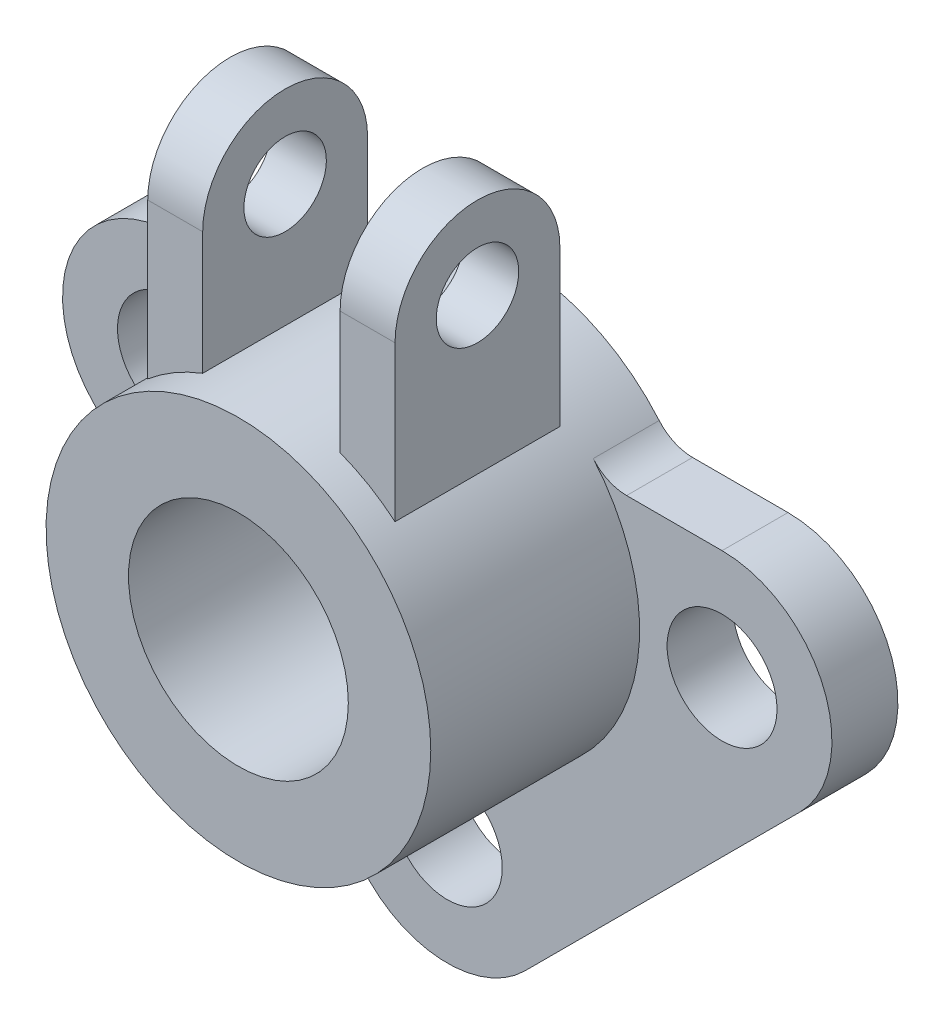
ISO-10303-21;
HEADER;
FILE_DESCRIPTION(('STEP AP214'),'2;1');
FILE_NAME('part.step','',(''),(''),'','','');
FILE_SCHEMA(('AUTOMOTIVE_DESIGN { 1 0 10303 214 1 1 1 1 }'));
ENDSEC;
DATA;
#1=APPLICATION_CONTEXT('core data for automotive mechanical design processes');
#2=APPLICATION_PROTOCOL_DEFINITION('international standard','automotive_design',2000,#1);
#3=PRODUCT_CONTEXT('',#1,'mechanical');
#4=PRODUCT('Part','Part','',(#3));
#5=PRODUCT_RELATED_PRODUCT_CATEGORY('part','',(#4));
#6=PRODUCT_DEFINITION_FORMATION('','',#4);
#7=PRODUCT_DEFINITION_CONTEXT('part definition',#1,'design');
#8=PRODUCT_DEFINITION('design','',#6,#7);
#9=PRODUCT_DEFINITION_SHAPE('','',#8);
#10=(LENGTH_UNIT() NAMED_UNIT(*) SI_UNIT(.MILLI.,.METRE.));
#11=(NAMED_UNIT(*) PLANE_ANGLE_UNIT() SI_UNIT($,.RADIAN.));
#12=(NAMED_UNIT(*) SI_UNIT($,.STERADIAN.) SOLID_ANGLE_UNIT());
#13=UNCERTAINTY_MEASURE_WITH_UNIT(LENGTH_MEASURE(1.E-05),#10,'distance_accuracy_value','');
#14=(GEOMETRIC_REPRESENTATION_CONTEXT(3) GLOBAL_UNCERTAINTY_ASSIGNED_CONTEXT((#13)) GLOBAL_UNIT_ASSIGNED_CONTEXT((#10,
#11,#12)) REPRESENTATION_CONTEXT('',''));
#15=CARTESIAN_POINT('',(0.,0.,0.));
#16=DIRECTION('',(0.,0.,1.));
#17=DIRECTION('',(1.,0.,0.));
#18=AXIS2_PLACEMENT_3D('',#15,#16,#17);
#19=CARTESIAN_POINT('',(225.,700.,140.));
#20=DIRECTION('',(1.,0.,0.));
#21=DIRECTION('',(0.,1.,0.));
#22=AXIS2_PLACEMENT_3D('',#19,#20,#21);
#23=PLANE('',#22);
#24=CARTESIAN_POINT('',(225.,550.,290.));
#25=DIRECTION('',(1.,0.,0.));
#26=DIRECTION('',(0.,1.,0.));
#27=AXIS2_PLACEMENT_3D('',#24,#25,#26);
#28=CIRCLE('',#27,75.);
#29=CARTESIAN_POINT('',(225.,625.,290.));
#30=VERTEX_POINT('',#29);
#31=EDGE_CURVE('E594',#30,#30,#28,.T.);
#32=ORIENTED_EDGE('',*,*,#31,.F.);
#33=EDGE_LOOP('',(#32));
#34=FACE_BOUND('',#33,.T.);
#35=DIRECTION('',(0.,1.,0.));
#36=VECTOR('',#35,1.);
#37=CARTESIAN_POINT('',(225.,700.,140.));
#38=LINE('',#37,#36);
#39=CARTESIAN_POINT('',(225.,268.09513236909,140.));
#40=VERTEX_POINT('',#39);
#41=CARTESIAN_POINT('',(225.,550.,140.));
#42=VERTEX_POINT('',#41);
#43=EDGE_CURVE('E225',#40,#42,#38,.T.);
#44=ORIENTED_EDGE('',*,*,#43,.T.);
#45=CARTESIAN_POINT('',(225.,550.,290.));
#46=DIRECTION('',(1.,0.,0.));
#47=DIRECTION('',(0.,1.,0.));
#48=AXIS2_PLACEMENT_3D('',#45,#46,#47);
#49=CIRCLE('',#48,150.);
#50=CARTESIAN_POINT('',(225.,550.,440.));
#51=VERTEX_POINT('',#50);
#52=EDGE_CURVE('E208',#42,#51,#49,.T.);
#53=ORIENTED_EDGE('',*,*,#52,.T.);
#54=DIRECTION('',(0.,1.,0.));
#55=VECTOR('',#54,1.);
#56=CARTESIAN_POINT('',(225.,700.,440.));
#57=LINE('',#56,#55);
#58=CARTESIAN_POINT('',(225.,268.09513236909,440.));
#59=VERTEX_POINT('',#58);
#60=EDGE_CURVE('E251',#59,#51,#57,.T.);
#61=ORIENTED_EDGE('',*,*,#60,.F.);
#62=DIRECTION('',(0.,0.,1.));
#63=VECTOR('',#62,1.);
#64=CARTESIAN_POINT('',(225.,268.09513236909,140.));
#65=LINE('',#64,#63);
#66=EDGE_CURVE('E233',#40,#59,#65,.T.);
#67=ORIENTED_EDGE('',*,*,#66,.F.);
#68=EDGE_LOOP('',(#44,#53,#61,#67));
#69=FACE_BOUND('',#68,.T.);
#70=ADVANCED_FACE('F83',(#34,#69),#23,.T.);
#71=CARTESIAN_POINT('',(125.,700.,140.));
#72=DIRECTION('',(-1.,0.,0.));
#73=DIRECTION('',(0.,-1.,0.));
#74=AXIS2_PLACEMENT_3D('',#71,#72,#73);
#75=PLANE('',#74);
#76=CARTESIAN_POINT('',(125.,550.,290.));
#77=DIRECTION('',(-1.,0.,0.));
#78=DIRECTION('',(0.,-1.,0.));
#79=AXIS2_PLACEMENT_3D('',#76,#77,#78);
#80=CIRCLE('',#79,75.);
#81=CARTESIAN_POINT('',(125.,475.,290.));
#82=VERTEX_POINT('',#81);
#83=EDGE_CURVE('E503',#82,#82,#80,.T.);
#84=ORIENTED_EDGE('',*,*,#83,.F.);
#85=EDGE_LOOP('',(#84));
#86=FACE_BOUND('',#85,.T.);
#87=CARTESIAN_POINT('',(125.,550.,290.));
#88=DIRECTION('',(-1.,0.,0.));
#89=DIRECTION('',(0.,-1.,0.));
#90=AXIS2_PLACEMENT_3D('',#87,#88,#89);
#91=CIRCLE('',#90,150.);
#92=CARTESIAN_POINT('',(125.,550.,440.));
#93=VERTEX_POINT('',#92);
#94=CARTESIAN_POINT('',(125.,550.,140.));
#95=VERTEX_POINT('',#94);
#96=EDGE_CURVE('E100',#93,#95,#91,.T.);
#97=ORIENTED_EDGE('',*,*,#96,.T.);
#98=DIRECTION('',(0.,-1.,0.));
#99=VECTOR('',#98,1.);
#100=CARTESIAN_POINT('',(125.,700.,140.));
#101=LINE('',#100,#99);
#102=CARTESIAN_POINT('',(125.,326.91742076555,140.));
#103=VERTEX_POINT('',#102);
#104=EDGE_CURVE('E227',#95,#103,#101,.T.);
#105=ORIENTED_EDGE('',*,*,#104,.T.);
#106=DIRECTION('',(0.,0.,1.));
#107=VECTOR('',#106,1.);
#108=CARTESIAN_POINT('',(125.,326.91742076555,140.));
#109=LINE('',#108,#107);
#110=CARTESIAN_POINT('',(125.,326.91742076555,440.));
#111=VERTEX_POINT('',#110);
#112=EDGE_CURVE('E250',#103,#111,#109,.T.);
#113=ORIENTED_EDGE('',*,*,#112,.T.);
#114=DIRECTION('',(0.,-1.,0.));
#115=VECTOR('',#114,1.);
#116=CARTESIAN_POINT('',(125.,700.,440.));
#117=LINE('',#116,#115);
#118=EDGE_CURVE('E242',#93,#111,#117,.T.);
#119=ORIENTED_EDGE('',*,*,#118,.F.);
#120=EDGE_LOOP('',(#97,#105,#113,#119));
#121=FACE_BOUND('',#120,.T.);
#122=ADVANCED_FACE('F458',(#86,#121),#75,.T.);
#123=CARTESIAN_POINT('',(-225.,700.,140.));
#124=DIRECTION('',(-1.,0.,0.));
#125=DIRECTION('',(0.,-1.,0.));
#126=AXIS2_PLACEMENT_3D('',#123,#124,#125);
#127=PLANE('',#126);
#128=CARTESIAN_POINT('',(-225.,550.,290.));
#129=DIRECTION('',(-1.,0.,0.));
#130=DIRECTION('',(0.,-1.,0.));
#131=AXIS2_PLACEMENT_3D('',#128,#129,#130);
#132=CIRCLE('',#131,75.);
#133=CARTESIAN_POINT('',(-225.,475.,290.));
#134=VERTEX_POINT('',#133);
#135=EDGE_CURVE('E230',#134,#134,#132,.F.);
#136=ORIENTED_EDGE('',*,*,#135,.T.);
#137=EDGE_LOOP('',(#136));
#138=FACE_BOUND('',#137,.T.);
#139=CARTESIAN_POINT('',(-225.,550.,290.));
#140=DIRECTION('',(-1.,0.,0.));
#141=DIRECTION('',(0.,-1.,0.));
#142=AXIS2_PLACEMENT_3D('',#139,#140,#141);
#143=CIRCLE('',#142,150.);
#144=CARTESIAN_POINT('',(-225.,550.,140.));
#145=VERTEX_POINT('',#144);
#146=CARTESIAN_POINT('',(-225.,550.,440.));
#147=VERTEX_POINT('',#146);
#148=EDGE_CURVE('E108',#145,#147,#143,.F.);
#149=ORIENTED_EDGE('',*,*,#148,.F.);
#150=DIRECTION('',(0.,-1.,0.));
#151=VECTOR('',#150,1.);
#152=CARTESIAN_POINT('',(-225.,700.,140.));
#153=LINE('',#152,#151);
#154=CARTESIAN_POINT('',(-225.,268.09513236909,140.));
#155=VERTEX_POINT('',#154);
#156=EDGE_CURVE('E479',#145,#155,#153,.T.);
#157=ORIENTED_EDGE('',*,*,#156,.T.);
#158=DIRECTION('',(0.,0.,1.));
#159=VECTOR('',#158,1.);
#160=CARTESIAN_POINT('',(-225.,268.09513236909,140.));
#161=LINE('',#160,#159);
#162=CARTESIAN_POINT('',(-225.,268.09513236909,440.));
#163=VERTEX_POINT('',#162);
#164=EDGE_CURVE('E254',#155,#163,#161,.T.);
#165=ORIENTED_EDGE('',*,*,#164,.T.);
#166=DIRECTION('',(0.,-1.,0.));
#167=VECTOR('',#166,1.);
#168=CARTESIAN_POINT('',(-225.,700.,440.));
#169=LINE('',#168,#167);
#170=EDGE_CURVE('E475',#147,#163,#169,.T.);
#171=ORIENTED_EDGE('',*,*,#170,.F.);
#172=EDGE_LOOP('',(#149,#157,#165,#171));
#173=FACE_BOUND('',#172,.T.);
#174=ADVANCED_FACE('F500',(#138,#173),#127,.T.);
#175=CARTESIAN_POINT('',(-125.,700.,140.));
#176=DIRECTION('',(1.,0.,0.));
#177=DIRECTION('',(0.,1.,0.));
#178=AXIS2_PLACEMENT_3D('',#175,#176,#177);
#179=PLANE('',#178);
#180=CARTESIAN_POINT('',(-125.,550.,290.));
#181=DIRECTION('',(1.,0.,0.));
#182=DIRECTION('',(0.,1.,0.));
#183=AXIS2_PLACEMENT_3D('',#180,#181,#182);
#184=CIRCLE('',#183,75.);
#185=CARTESIAN_POINT('',(-125.,625.,290.));
#186=VERTEX_POINT('',#185);
#187=EDGE_CURVE('E87',#186,#186,#184,.T.);
#188=ORIENTED_EDGE('',*,*,#187,.F.);
#189=EDGE_LOOP('',(#188));
#190=FACE_BOUND('',#189,.T.);
#191=DIRECTION('',(0.,1.,0.));
#192=VECTOR('',#191,1.);
#193=CARTESIAN_POINT('',(-125.,700.,140.));
#194=LINE('',#193,#192);
#195=CARTESIAN_POINT('',(-125.,326.91742076555,140.));
#196=VERTEX_POINT('',#195);
#197=CARTESIAN_POINT('',(-125.,550.,140.));
#198=VERTEX_POINT('',#197);
#199=EDGE_CURVE('E474',#196,#198,#194,.T.);
#200=ORIENTED_EDGE('',*,*,#199,.T.);
#201=CARTESIAN_POINT('',(-125.,550.,290.));
#202=DIRECTION('',(1.,0.,0.));
#203=DIRECTION('',(0.,1.,0.));
#204=AXIS2_PLACEMENT_3D('',#201,#202,#203);
#205=CIRCLE('',#204,150.);
#206=CARTESIAN_POINT('',(-125.,550.,440.));
#207=VERTEX_POINT('',#206);
#208=EDGE_CURVE('E218',#198,#207,#205,.T.);
#209=ORIENTED_EDGE('',*,*,#208,.T.);
#210=DIRECTION('',(0.,1.,0.));
#211=VECTOR('',#210,1.);
#212=CARTESIAN_POINT('',(-125.,700.,440.));
#213=LINE('',#212,#211);
#214=CARTESIAN_POINT('',(-125.,326.91742076555,440.));
#215=VERTEX_POINT('',#214);
#216=EDGE_CURVE('E465',#215,#207,#213,.T.);
#217=ORIENTED_EDGE('',*,*,#216,.F.);
#218=DIRECTION('',(0.,0.,1.));
#219=VECTOR('',#218,1.);
#220=CARTESIAN_POINT('',(-125.,326.91742076555,140.));
#221=LINE('',#220,#219);
#222=EDGE_CURVE('E245',#196,#215,#221,.T.);
#223=ORIENTED_EDGE('',*,*,#222,.F.);
#224=EDGE_LOOP('',(#200,#209,#217,#223));
#225=FACE_BOUND('',#224,.T.);
#226=ADVANCED_FACE('F498',(#190,#225),#179,.T.);
#227=CARTESIAN_POINT('',(0.,0.,140.));
#228=DIRECTION('',(0.,0.,-1.));
#229=DIRECTION('',(-1.,0.,0.));
#230=AXIS2_PLACEMENT_3D('',#227,#228,#229);
#231=PLANE('',#230);
#232=ORIENTED_EDGE('',*,*,#156,.F.);
#233=DIRECTION('',(1.,0.,0.));
#234=VECTOR('',#233,1.);
#235=CARTESIAN_POINT('',(-437.132034355965,550.,140.));
#236=LINE('',#235,#234);
#237=EDGE_CURVE('E229',#145,#198,#236,.T.);
#238=ORIENTED_EDGE('',*,*,#237,.T.);
#239=ORIENTED_EDGE('',*,*,#199,.F.);
#240=CARTESIAN_POINT('',(0.,0.,140.));
#241=DIRECTION('',(0.,0.,-1.));
#242=DIRECTION('',(-1.,0.,0.));
#243=AXIS2_PLACEMENT_3D('',#240,#241,#242);
#244=CIRCLE('',#243,350.);
#245=EDGE_CURVE('E471',#155,#196,#244,.T.);
#246=ORIENTED_EDGE('',*,*,#245,.F.);
#247=EDGE_LOOP('',(#232,#238,#239,#246));
#248=FACE_BOUND('',#247,.T.);
#249=ADVANCED_FACE('F509',(#248),#231,.T.);
#250=CARTESIAN_POINT('',(0.,0.,440.));
#251=DIRECTION('',(0.,0.,-1.));
#252=DIRECTION('',(-1.,0.,0.));
#253=AXIS2_PLACEMENT_3D('',#250,#251,#252);
#254=PLANE('',#253);
#255=DIRECTION('',(1.,0.,0.));
#256=VECTOR('',#255,1.);
#257=CARTESIAN_POINT('',(-437.132034355965,550.,440.));
#258=LINE('',#257,#256);
#259=EDGE_CURVE('E219',#147,#207,#258,.T.);
#260=ORIENTED_EDGE('',*,*,#259,.F.);
#261=ORIENTED_EDGE('',*,*,#170,.T.);
#262=CARTESIAN_POINT('',(0.,0.,440.));
#263=DIRECTION('',(0.,0.,-1.));
#264=DIRECTION('',(-1.,0.,0.));
#265=AXIS2_PLACEMENT_3D('',#262,#263,#264);
#266=CIRCLE('',#265,350.);
#267=EDGE_CURVE('E460',#163,#215,#266,.T.);
#268=ORIENTED_EDGE('',*,*,#267,.T.);
#269=ORIENTED_EDGE('',*,*,#216,.T.);
#270=EDGE_LOOP('',(#260,#261,#268,#269));
#271=FACE_BOUND('',#270,.T.);
#272=ADVANCED_FACE('F449',(#271),#254,.F.);
#273=CARTESIAN_POINT('',(0.,0.,500.));
#274=DIRECTION('',(0.,0.,-1.));
#275=DIRECTION('',(-1.,0.,0.));
#276=AXIS2_PLACEMENT_3D('',#273,#274,#275);
#277=CYLINDRICAL_SURFACE('',#276,350.);
#278=ORIENTED_EDGE('',*,*,#164,.F.);
#279=ORIENTED_EDGE('',*,*,#245,.T.);
#280=ORIENTED_EDGE('',*,*,#222,.T.);
#281=ORIENTED_EDGE('',*,*,#267,.F.);
#282=EDGE_LOOP('',(#278,#279,#280,#281));
#283=FACE_BOUND('',#282,.T.);
#284=CARTESIAN_POINT('',(0.,0.,0.));
#285=DIRECTION('',(0.,0.,1.));
#286=DIRECTION('',(1.,0.,0.));
#287=AXIS2_PLACEMENT_3D('',#284,#285,#286);
#288=CIRCLE('',#287,350.);
#289=CARTESIAN_POINT('',(265.628330475733,227.906976744186,0.));
#290=VERTEX_POINT('',#289);
#291=CARTESIAN_POINT('',(-265.628330475733,227.906976744186,0.));
#292=VERTEX_POINT('',#291);
#293=EDGE_CURVE('E371',#290,#292,#288,.T.);
#294=ORIENTED_EDGE('',*,*,#293,.T.);
#295=DIRECTION('',(0.,0.,-1.));
#296=VECTOR('',#295,1.);
#297=CARTESIAN_POINT('',(-265.628330475733,227.906976744186,500.));
#298=LINE('',#297,#296);
#299=CARTESIAN_POINT('',(-265.628330475733,227.906976744186,120.));
#300=VERTEX_POINT('',#299);
#301=EDGE_CURVE('E389',#292,#300,#298,.F.);
#302=ORIENTED_EDGE('',*,*,#301,.T.);
#303=CARTESIAN_POINT('',(0.,0.,120.));
#304=DIRECTION('',(0.,0.,1.));
#305=DIRECTION('',(1.,0.,0.));
#306=AXIS2_PLACEMENT_3D('',#303,#304,#305);
#307=CIRCLE('',#306,350.);
#308=CARTESIAN_POINT('',(265.628330475733,227.906976744186,120.));
#309=VERTEX_POINT('',#308);
#310=EDGE_CURVE('E267',#300,#309,#307,.T.);
#311=ORIENTED_EDGE('',*,*,#310,.T.);
#312=DIRECTION('',(0.,0.,-1.));
#313=VECTOR('',#312,1.);
#314=CARTESIAN_POINT('',(265.628330475733,227.906976744186,500.));
#315=LINE('',#314,#313);
#316=EDGE_CURVE('E385',#309,#290,#315,.T.);
#317=ORIENTED_EDGE('',*,*,#316,.T.);
#318=EDGE_LOOP('',(#294,#302,#311,#317));
#319=FACE_BOUND('',#318,.T.);
#320=CARTESIAN_POINT('',(0.,0.,500.));
#321=DIRECTION('',(0.,0.,1.));
#322=DIRECTION('',(1.,0.,0.));
#323=AXIS2_PLACEMENT_3D('',#320,#321,#322);
#324=CIRCLE('',#323,350.);
#325=CARTESIAN_POINT('',(350.,0.,500.));
#326=VERTEX_POINT('',#325);
#327=EDGE_CURVE('E370',#326,#326,#324,.T.);
#328=ORIENTED_EDGE('',*,*,#327,.F.);
#329=EDGE_LOOP('',(#328));
#330=FACE_BOUND('',#329,.T.);
#331=CARTESIAN_POINT('',(0.,0.,140.));
#332=DIRECTION('',(0.,0.,-1.));
#333=DIRECTION('',(1.,0.,0.));
#334=AXIS2_PLACEMENT_3D('',#331,#332,#333);
#335=CIRCLE('',#334,350.);
#336=EDGE_CURVE('E239',#103,#40,#335,.T.);
#337=ORIENTED_EDGE('',*,*,#336,.T.);
#338=ORIENTED_EDGE('',*,*,#66,.T.);
#339=CARTESIAN_POINT('',(0.,0.,440.));
#340=DIRECTION('',(0.,0.,-1.));
#341=DIRECTION('',(1.,0.,0.));
#342=AXIS2_PLACEMENT_3D('',#339,#340,#341);
#343=CIRCLE('',#342,350.);
#344=EDGE_CURVE('E235',#111,#59,#343,.T.);
#345=ORIENTED_EDGE('',*,*,#344,.F.);
#346=ORIENTED_EDGE('',*,*,#112,.F.);
#347=EDGE_LOOP('',(#337,#338,#345,#346));
#348=FACE_BOUND('',#347,.T.);
#349=ADVANCED_FACE('F445',(#283,#319,#330,#348),#277,.T.);
#350=CARTESIAN_POINT('',(0.,0.,500.));
#351=DIRECTION('',(0.,0.,-1.));
#352=DIRECTION('',(-1.,0.,0.));
#353=AXIS2_PLACEMENT_3D('',#350,#351,#352);
#354=CYLINDRICAL_SURFACE('',#353,200.);
#355=CARTESIAN_POINT('',(0.,0.,500.));
#356=DIRECTION('',(0.,0.,1.));
#357=DIRECTION('',(1.,0.,0.));
#358=AXIS2_PLACEMENT_3D('',#355,#356,#357);
#359=CIRCLE('',#358,200.);
#360=CARTESIAN_POINT('',(200.,0.,500.));
#361=VERTEX_POINT('',#360);
#362=EDGE_CURVE('E366',#361,#361,#359,.T.);
#363=ORIENTED_EDGE('',*,*,#362,.T.);
#364=EDGE_LOOP('',(#363));
#365=FACE_BOUND('',#364,.T.);
#366=CARTESIAN_POINT('',(0.,0.,0.));
#367=DIRECTION('',(0.,0.,1.));
#368=DIRECTION('',(1.,0.,0.));
#369=AXIS2_PLACEMENT_3D('',#366,#367,#368);
#370=CIRCLE('',#369,200.);
#371=CARTESIAN_POINT('',(200.,0.,0.));
#372=VERTEX_POINT('',#371);
#373=EDGE_CURVE('E365',#372,#372,#370,.T.);
#374=ORIENTED_EDGE('',*,*,#373,.F.);
#375=EDGE_LOOP('',(#374));
#376=FACE_BOUND('',#375,.T.);
#377=ADVANCED_FACE('F448',(#365,#376),#354,.F.);
#378=CARTESIAN_POINT('',(0.,0.,500.));
#379=DIRECTION('',(0.,0.,1.));
#380=DIRECTION('',(1.,0.,0.));
#381=AXIS2_PLACEMENT_3D('',#378,#379,#380);
#382=PLANE('',#381);
#383=ORIENTED_EDGE('',*,*,#362,.F.);
#384=EDGE_LOOP('',(#383));
#385=FACE_BOUND('',#384,.T.);
#386=ORIENTED_EDGE('',*,*,#327,.T.);
#387=EDGE_LOOP('',(#386));
#388=FACE_BOUND('',#387,.T.);
#389=ADVANCED_FACE('F562',(#385,#388),#382,.T.);
#390=CARTESIAN_POINT('',(0.,0.,0.));
#391=DIRECTION('',(0.,0.,1.));
#392=DIRECTION('',(1.,0.,0.));
#393=AXIS2_PLACEMENT_3D('',#390,#391,#392);
#394=PLANE('',#393);
#395=ORIENTED_EDGE('',*,*,#373,.T.);
#396=EDGE_LOOP('',(#395));
#397=FACE_BOUND('',#396,.T.);
#398=ORIENTED_EDGE('',*,*,#293,.F.);
#399=CARTESIAN_POINT('',(326.343377441614,280.,0.));
#400=DIRECTION('',(0.,0.,1.));
#401=DIRECTION('',(1.,0.,0.));
#402=AXIS2_PLACEMENT_3D('',#399,#400,#401);
#403=CIRCLE('',#402,80.);
#404=CARTESIAN_POINT('',(326.343377441614,200.,0.));
#405=VERTEX_POINT('',#404);
#406=EDGE_CURVE('E93',#290,#405,#403,.T.);
#407=ORIENTED_EDGE('',*,*,#406,.T.);
#408=DIRECTION('',(-1.,0.,0.));
#409=VECTOR('',#408,1.);
#410=CARTESIAN_POINT('',(0.,200.,0.));
#411=LINE('',#410,#409);
#412=CARTESIAN_POINT('',(500.,200.,0.));
#413=VERTEX_POINT('',#412);
#414=EDGE_CURVE('E335',#413,#405,#411,.T.);
#415=ORIENTED_EDGE('',*,*,#414,.F.);
#416=CARTESIAN_POINT('',(500.,0.,0.));
#417=DIRECTION('',(0.,0.,1.));
#418=DIRECTION('',(1.,0.,0.));
#419=AXIS2_PLACEMENT_3D('',#416,#417,#418);
#420=CIRCLE('',#419,200.);
#421=CARTESIAN_POINT('',(641.421356237309,-141.42135623731,0.));
#422=VERTEX_POINT('',#421);
#423=EDGE_CURVE('E331',#422,#413,#420,.T.);
#424=ORIENTED_EDGE('',*,*,#423,.F.);
#425=DIRECTION('',(0.707106781186548,0.707106781186548,0.));
#426=VECTOR('',#425,1.);
#427=CARTESIAN_POINT('',(391.42135623731,-391.42135623731,0.));
#428=LINE('',#427,#426);
#429=CARTESIAN_POINT('',(141.42135623731,-641.421356237309,0.));
#430=VERTEX_POINT('',#429);
#431=EDGE_CURVE('E327',#430,#422,#428,.T.);
#432=ORIENTED_EDGE('',*,*,#431,.F.);
#433=CARTESIAN_POINT('',(0.,-500.,0.));
#434=DIRECTION('',(0.,0.,1.));
#435=DIRECTION('',(1.,0.,0.));
#436=AXIS2_PLACEMENT_3D('',#433,#434,#435);
#437=CIRCLE('',#436,200.);
#438=CARTESIAN_POINT('',(-141.42135623731,-641.421356237309,0.));
#439=VERTEX_POINT('',#438);
#440=EDGE_CURVE('E323',#430,#439,#437,.F.);
#441=ORIENTED_EDGE('',*,*,#440,.T.);
#442=DIRECTION('',(-0.707106781186548,0.707106781186548,0.));
#443=VECTOR('',#442,1.);
#444=CARTESIAN_POINT('',(-391.42135623731,-391.42135623731,0.));
#445=LINE('',#444,#443);
#446=CARTESIAN_POINT('',(-641.421356237309,-141.42135623731,0.));
#447=VERTEX_POINT('',#446);
#448=EDGE_CURVE('E319',#439,#447,#445,.T.);
#449=ORIENTED_EDGE('',*,*,#448,.T.);
#450=CARTESIAN_POINT('',(-500.,0.,0.));
#451=DIRECTION('',(0.,0.,1.));
#452=DIRECTION('',(1.,0.,0.));
#453=AXIS2_PLACEMENT_3D('',#450,#451,#452);
#454=CIRCLE('',#453,200.);
#455=CARTESIAN_POINT('',(-500.,200.,0.));
#456=VERTEX_POINT('',#455);
#457=EDGE_CURVE('E315',#447,#456,#454,.F.);
#458=ORIENTED_EDGE('',*,*,#457,.T.);
#459=DIRECTION('',(1.,0.,0.));
#460=VECTOR('',#459,1.);
#461=CARTESIAN_POINT('',(0.,200.,0.));
#462=LINE('',#461,#460);
#463=CARTESIAN_POINT('',(-326.343377441614,200.,0.));
#464=VERTEX_POINT('',#463);
#465=EDGE_CURVE('E311',#456,#464,#462,.T.);
#466=ORIENTED_EDGE('',*,*,#465,.T.);
#467=CARTESIAN_POINT('',(-326.343377441614,280.,0.));
#468=DIRECTION('',(0.,0.,1.));
#469=DIRECTION('',(1.,0.,0.));
#470=AXIS2_PLACEMENT_3D('',#467,#468,#469);
#471=CIRCLE('',#470,80.);
#472=EDGE_CURVE('E396',#464,#292,#471,.T.);
#473=ORIENTED_EDGE('',*,*,#472,.T.);
#474=EDGE_LOOP('',(#398,#407,#415,#424,#432,#441,#449,#458,#466,#473));
#475=FACE_BOUND('',#474,.T.);
#476=CARTESIAN_POINT('',(0.,-500.,0.));
#477=DIRECTION('',(0.,0.,1.));
#478=DIRECTION('',(1.,0.,0.));
#479=AXIS2_PLACEMENT_3D('',#476,#477,#478);
#480=CIRCLE('',#479,100.);
#481=CARTESIAN_POINT('',(99.9999999999999,-500.,0.));
#482=VERTEX_POINT('',#481);
#483=EDGE_CURVE('E259',#482,#482,#480,.T.);
#484=ORIENTED_EDGE('',*,*,#483,.T.);
#485=EDGE_LOOP('',(#484));
#486=FACE_BOUND('',#485,.T.);
#487=CARTESIAN_POINT('',(500.,0.,0.));
#488=DIRECTION('',(0.,0.,1.));
#489=DIRECTION('',(1.,0.,0.));
#490=AXIS2_PLACEMENT_3D('',#487,#488,#489);
#491=CIRCLE('',#490,100.);
#492=CARTESIAN_POINT('',(600.,0.,0.));
#493=VERTEX_POINT('',#492);
#494=EDGE_CURVE('E339',#493,#493,#491,.T.);
#495=ORIENTED_EDGE('',*,*,#494,.T.);
#496=EDGE_LOOP('',(#495));
#497=FACE_BOUND('',#496,.T.);
#498=CARTESIAN_POINT('',(-500.,0.,0.));
#499=DIRECTION('',(0.,0.,1.));
#500=DIRECTION('',(1.,0.,0.));
#501=AXIS2_PLACEMENT_3D('',#498,#499,#500);
#502=CIRCLE('',#501,100.);
#503=CARTESIAN_POINT('',(-400.,0.,0.));
#504=VERTEX_POINT('',#503);
#505=EDGE_CURVE('E268',#504,#504,#502,.T.);
#506=ORIENTED_EDGE('',*,*,#505,.T.);
#507=EDGE_LOOP('',(#506));
#508=FACE_BOUND('',#507,.T.);
#509=ADVANCED_FACE('F405',(#397,#475,#486,#497,#508),#394,.F.);
#510=CARTESIAN_POINT('',(0.,200.,120.));
#511=DIRECTION('',(0.,1.,0.));
#512=DIRECTION('',(0.,0.,1.));
#513=AXIS2_PLACEMENT_3D('',#510,#511,#512);
#514=PLANE('',#513);
#515=DIRECTION('',(1.,0.,0.));
#516=VECTOR('',#515,1.);
#517=CARTESIAN_POINT('',(0.,200.,120.));
#518=LINE('',#517,#516);
#519=CARTESIAN_POINT('',(-500.,200.,120.));
#520=VERTEX_POINT('',#519);
#521=CARTESIAN_POINT('',(-326.343377441614,200.,120.));
#522=VERTEX_POINT('',#521);
#523=EDGE_CURVE('E271',#520,#522,#518,.T.);
#524=ORIENTED_EDGE('',*,*,#523,.T.);
#525=DIRECTION('',(0.,0.,-1.));
#526=VECTOR('',#525,1.);
#527=CARTESIAN_POINT('',(-326.343377441614,200.,120.));
#528=LINE('',#527,#526);
#529=EDGE_CURVE('E375',#522,#464,#528,.T.);
#530=ORIENTED_EDGE('',*,*,#529,.T.);
#531=ORIENTED_EDGE('',*,*,#465,.F.);
#532=DIRECTION('',(0.,0.,-1.));
#533=VECTOR('',#532,1.);
#534=CARTESIAN_POINT('',(-500.,200.,120.));
#535=LINE('',#534,#533);
#536=EDGE_CURVE('E362',#520,#456,#535,.T.);
#537=ORIENTED_EDGE('',*,*,#536,.F.);
#538=EDGE_LOOP('',(#524,#530,#531,#537));
#539=FACE_BOUND('',#538,.T.);
#540=ADVANCED_FACE('F438',(#539),#514,.T.);
#541=CARTESIAN_POINT('',(-500.,0.,120.));
#542=DIRECTION('',(0.,0.,-1.));
#543=DIRECTION('',(-1.,0.,0.));
#544=AXIS2_PLACEMENT_3D('',#541,#542,#543);
#545=CYLINDRICAL_SURFACE('',#544,200.);
#546=ORIENTED_EDGE('',*,*,#457,.F.);
#547=DIRECTION('',(0.,0.,-1.));
#548=VECTOR('',#547,1.);
#549=CARTESIAN_POINT('',(-641.421356237309,-141.42135623731,120.));
#550=LINE('',#549,#548);
#551=CARTESIAN_POINT('',(-641.421356237309,-141.42135623731,120.));
#552=VERTEX_POINT('',#551);
#553=EDGE_CURVE('E359',#552,#447,#550,.T.);
#554=ORIENTED_EDGE('',*,*,#553,.F.);
#555=CARTESIAN_POINT('',(-500.,0.,120.));
#556=DIRECTION('',(0.,0.,1.));
#557=DIRECTION('',(1.,0.,0.));
#558=AXIS2_PLACEMENT_3D('',#555,#556,#557);
#559=CIRCLE('',#558,200.);
#560=EDGE_CURVE('E275',#552,#520,#559,.F.);
#561=ORIENTED_EDGE('',*,*,#560,.T.);
#562=ORIENTED_EDGE('',*,*,#536,.T.);
#563=EDGE_LOOP('',(#546,#554,#561,#562));
#564=FACE_BOUND('',#563,.T.);
#565=ADVANCED_FACE('F434',(#564),#545,.T.);
#566=CARTESIAN_POINT('',(-391.42135623731,-391.42135623731,120.));
#567=DIRECTION('',(-0.707106781186547,-0.707106781186547,0.));
#568=DIRECTION('',(0.707106781186548,-0.707106781186548,0.));
#569=AXIS2_PLACEMENT_3D('',#566,#567,#568);
#570=PLANE('',#569);
#571=ORIENTED_EDGE('',*,*,#448,.F.);
#572=DIRECTION('',(0.,0.,-1.));
#573=VECTOR('',#572,1.);
#574=CARTESIAN_POINT('',(-141.42135623731,-641.421356237309,120.));
#575=LINE('',#574,#573);
#576=CARTESIAN_POINT('',(-141.42135623731,-641.421356237309,120.));
#577=VERTEX_POINT('',#576);
#578=EDGE_CURVE('E356',#577,#439,#575,.T.);
#579=ORIENTED_EDGE('',*,*,#578,.F.);
#580=DIRECTION('',(-0.707106781186548,0.707106781186548,0.));
#581=VECTOR('',#580,1.);
#582=CARTESIAN_POINT('',(-391.42135623731,-391.42135623731,120.));
#583=LINE('',#582,#581);
#584=EDGE_CURVE('E279',#577,#552,#583,.T.);
#585=ORIENTED_EDGE('',*,*,#584,.T.);
#586=ORIENTED_EDGE('',*,*,#553,.T.);
#587=EDGE_LOOP('',(#571,#579,#585,#586));
#588=FACE_BOUND('',#587,.T.);
#589=ADVANCED_FACE('F430',(#588),#570,.T.);
#590=CARTESIAN_POINT('',(0.,-500.,120.));
#591=DIRECTION('',(0.,0.,-1.));
#592=DIRECTION('',(-1.,0.,0.));
#593=AXIS2_PLACEMENT_3D('',#590,#591,#592);
#594=CYLINDRICAL_SURFACE('',#593,200.);
#595=ORIENTED_EDGE('',*,*,#440,.F.);
#596=DIRECTION('',(0.,0.,-1.));
#597=VECTOR('',#596,1.);
#598=CARTESIAN_POINT('',(141.42135623731,-641.421356237309,120.));
#599=LINE('',#598,#597);
#600=CARTESIAN_POINT('',(141.42135623731,-641.421356237309,120.));
#601=VERTEX_POINT('',#600);
#602=EDGE_CURVE('E353',#601,#430,#599,.T.);
#603=ORIENTED_EDGE('',*,*,#602,.F.);
#604=CARTESIAN_POINT('',(0.,-500.,120.));
#605=DIRECTION('',(0.,0.,1.));
#606=DIRECTION('',(1.,0.,0.));
#607=AXIS2_PLACEMENT_3D('',#604,#605,#606);
#608=CIRCLE('',#607,200.);
#609=EDGE_CURVE('E283',#601,#577,#608,.F.);
#610=ORIENTED_EDGE('',*,*,#609,.T.);
#611=ORIENTED_EDGE('',*,*,#578,.T.);
#612=EDGE_LOOP('',(#595,#603,#610,#611));
#613=FACE_BOUND('',#612,.T.);
#614=ADVANCED_FACE('F426',(#613),#594,.T.);
#615=CARTESIAN_POINT('',(391.42135623731,-391.42135623731,120.));
#616=DIRECTION('',(-0.707106781186547,0.707106781186547,0.));
#617=DIRECTION('',(-0.707106781186548,-0.707106781186548,0.));
#618=AXIS2_PLACEMENT_3D('',#615,#616,#617);
#619=PLANE('',#618);
#620=ORIENTED_EDGE('',*,*,#431,.T.);
#621=DIRECTION('',(0.,0.,-1.));
#622=VECTOR('',#621,1.);
#623=CARTESIAN_POINT('',(641.421356237309,-141.42135623731,120.));
#624=LINE('',#623,#622);
#625=CARTESIAN_POINT('',(641.421356237309,-141.42135623731,120.));
#626=VERTEX_POINT('',#625);
#627=EDGE_CURVE('E349',#626,#422,#624,.T.);
#628=ORIENTED_EDGE('',*,*,#627,.F.);
#629=DIRECTION('',(0.707106781186548,0.707106781186548,0.));
#630=VECTOR('',#629,1.);
#631=CARTESIAN_POINT('',(391.42135623731,-391.42135623731,120.));
#632=LINE('',#631,#630);
#633=EDGE_CURVE('E287',#601,#626,#632,.T.);
#634=ORIENTED_EDGE('',*,*,#633,.F.);
#635=ORIENTED_EDGE('',*,*,#602,.T.);
#636=EDGE_LOOP('',(#620,#628,#634,#635));
#637=FACE_BOUND('',#636,.T.);
#638=ADVANCED_FACE('F548',(#637),#619,.F.);
#639=CARTESIAN_POINT('',(500.,0.,120.));
#640=DIRECTION('',(0.,0.,-1.));
#641=DIRECTION('',(-1.,0.,0.));
#642=AXIS2_PLACEMENT_3D('',#639,#640,#641);
#643=CYLINDRICAL_SURFACE('',#642,200.);
#644=ORIENTED_EDGE('',*,*,#423,.T.);
#645=DIRECTION('',(0.,0.,-1.));
#646=VECTOR('',#645,1.);
#647=CARTESIAN_POINT('',(500.,200.,120.));
#648=LINE('',#647,#646);
#649=CARTESIAN_POINT('',(500.,200.,120.));
#650=VERTEX_POINT('',#649);
#651=EDGE_CURVE('E307',#650,#413,#648,.T.);
#652=ORIENTED_EDGE('',*,*,#651,.F.);
#653=CARTESIAN_POINT('',(500.,0.,120.));
#654=DIRECTION('',(0.,0.,1.));
#655=DIRECTION('',(1.,0.,0.));
#656=AXIS2_PLACEMENT_3D('',#653,#654,#655);
#657=CIRCLE('',#656,200.);
#658=EDGE_CURVE('E291',#626,#650,#657,.T.);
#659=ORIENTED_EDGE('',*,*,#658,.F.);
#660=ORIENTED_EDGE('',*,*,#627,.T.);
#661=EDGE_LOOP('',(#644,#652,#659,#660));
#662=FACE_BOUND('',#661,.T.);
#663=ADVANCED_FACE('F421',(#662),#643,.T.);
#664=CARTESIAN_POINT('',(500.,0.,120.));
#665=DIRECTION('',(0.,0.,-1.));
#666=DIRECTION('',(-1.,0.,0.));
#667=AXIS2_PLACEMENT_3D('',#664,#665,#666);
#668=CYLINDRICAL_SURFACE('',#667,100.);
#669=CARTESIAN_POINT('',(500.,0.,120.));
#670=DIRECTION('',(0.,0.,1.));
#671=DIRECTION('',(1.,0.,0.));
#672=AXIS2_PLACEMENT_3D('',#669,#670,#671);
#673=CIRCLE('',#672,100.);
#674=CARTESIAN_POINT('',(600.,0.,120.));
#675=VERTEX_POINT('',#674);
#676=EDGE_CURVE('E299',#675,#675,#673,.T.);
#677=ORIENTED_EDGE('',*,*,#676,.T.);
#678=EDGE_LOOP('',(#677));
#679=FACE_BOUND('',#678,.T.);
#680=ORIENTED_EDGE('',*,*,#494,.F.);
#681=EDGE_LOOP('',(#680));
#682=FACE_BOUND('',#681,.T.);
#683=ADVANCED_FACE('F540',(#679,#682),#668,.F.);
#684=CARTESIAN_POINT('',(0.,200.,120.));
#685=DIRECTION('',(0.,-1.,0.));
#686=DIRECTION('',(0.,0.,-1.));
#687=AXIS2_PLACEMENT_3D('',#684,#685,#686);
#688=PLANE('',#687);
#689=ORIENTED_EDGE('',*,*,#414,.T.);
#690=DIRECTION('',(0.,0.,1.));
#691=VECTOR('',#690,1.);
#692=CARTESIAN_POINT('',(326.343377441614,200.,120.));
#693=LINE('',#692,#691);
#694=CARTESIAN_POINT('',(326.343377441614,200.,120.));
#695=VERTEX_POINT('',#694);
#696=EDGE_CURVE('E393',#405,#695,#693,.T.);
#697=ORIENTED_EDGE('',*,*,#696,.T.);
#698=DIRECTION('',(-1.,0.,0.));
#699=VECTOR('',#698,1.);
#700=CARTESIAN_POINT('',(0.,200.,120.));
#701=LINE('',#700,#699);
#702=EDGE_CURVE('E295',#650,#695,#701,.T.);
#703=ORIENTED_EDGE('',*,*,#702,.F.);
#704=ORIENTED_EDGE('',*,*,#651,.T.);
#705=EDGE_LOOP('',(#689,#697,#703,#704));
#706=FACE_BOUND('',#705,.T.);
#707=ADVANCED_FACE('F411',(#706),#688,.F.);
#708=CARTESIAN_POINT('',(0.,-500.,120.));
#709=DIRECTION('',(0.,0.,-1.));
#710=DIRECTION('',(-1.,0.,0.));
#711=AXIS2_PLACEMENT_3D('',#708,#709,#710);
#712=CYLINDRICAL_SURFACE('',#711,100.);
#713=CARTESIAN_POINT('',(0.,-500.,120.));
#714=DIRECTION('',(0.,0.,1.));
#715=DIRECTION('',(1.,0.,0.));
#716=AXIS2_PLACEMENT_3D('',#713,#714,#715);
#717=CIRCLE('',#716,100.);
#718=CARTESIAN_POINT('',(99.9999999999999,-500.,120.));
#719=VERTEX_POINT('',#718);
#720=EDGE_CURVE('E263',#719,#719,#717,.T.);
#721=ORIENTED_EDGE('',*,*,#720,.T.);
#722=EDGE_LOOP('',(#721));
#723=FACE_BOUND('',#722,.T.);
#724=ORIENTED_EDGE('',*,*,#483,.F.);
#725=EDGE_LOOP('',(#724));
#726=FACE_BOUND('',#725,.T.);
#727=ADVANCED_FACE('F538',(#723,#726),#712,.F.);
#728=CARTESIAN_POINT('',(-500.,0.,120.));
#729=DIRECTION('',(0.,0.,-1.));
#730=DIRECTION('',(-1.,0.,0.));
#731=AXIS2_PLACEMENT_3D('',#728,#729,#730);
#732=CYLINDRICAL_SURFACE('',#731,100.);
#733=CARTESIAN_POINT('',(-500.,0.,120.));
#734=DIRECTION('',(0.,0.,1.));
#735=DIRECTION('',(1.,0.,0.));
#736=AXIS2_PLACEMENT_3D('',#733,#734,#735);
#737=CIRCLE('',#736,100.);
#738=CARTESIAN_POINT('',(-400.,0.,120.));
#739=VERTEX_POINT('',#738);
#740=EDGE_CURVE('E303',#739,#739,#737,.T.);
#741=ORIENTED_EDGE('',*,*,#740,.T.);
#742=EDGE_LOOP('',(#741));
#743=FACE_BOUND('',#742,.T.);
#744=ORIENTED_EDGE('',*,*,#505,.F.);
#745=EDGE_LOOP('',(#744));
#746=FACE_BOUND('',#745,.T.);
#747=ADVANCED_FACE('F534',(#743,#746),#732,.F.);
#748=CARTESIAN_POINT('',(0.,0.,120.));
#749=DIRECTION('',(0.,0.,1.));
#750=DIRECTION('',(1.,0.,0.));
#751=AXIS2_PLACEMENT_3D('',#748,#749,#750);
#752=PLANE('',#751);
#753=ORIENTED_EDGE('',*,*,#720,.F.);
#754=EDGE_LOOP('',(#753));
#755=FACE_BOUND('',#754,.T.);
#756=ORIENTED_EDGE('',*,*,#310,.F.);
#757=CARTESIAN_POINT('',(-326.343377441614,280.,120.));
#758=DIRECTION('',(0.,0.,1.));
#759=DIRECTION('',(1.,0.,0.));
#760=AXIS2_PLACEMENT_3D('',#757,#758,#759);
#761=CIRCLE('',#760,80.);
#762=EDGE_CURVE('E399',#300,#522,#761,.F.);
#763=ORIENTED_EDGE('',*,*,#762,.T.);
#764=ORIENTED_EDGE('',*,*,#523,.F.);
#765=ORIENTED_EDGE('',*,*,#560,.F.);
#766=ORIENTED_EDGE('',*,*,#584,.F.);
#767=ORIENTED_EDGE('',*,*,#609,.F.);
#768=ORIENTED_EDGE('',*,*,#633,.T.);
#769=ORIENTED_EDGE('',*,*,#658,.T.);
#770=ORIENTED_EDGE('',*,*,#702,.T.);
#771=CARTESIAN_POINT('',(326.343377441614,280.,120.));
#772=DIRECTION('',(0.,0.,1.));
#773=DIRECTION('',(1.,0.,0.));
#774=AXIS2_PLACEMENT_3D('',#771,#772,#773);
#775=CIRCLE('',#774,80.);
#776=EDGE_CURVE('E12',#695,#309,#775,.F.);
#777=ORIENTED_EDGE('',*,*,#776,.T.);
#778=EDGE_LOOP('',(#756,#763,#764,#765,#766,#767,#768,#769,#770,#777));
#779=FACE_BOUND('',#778,.T.);
#780=ORIENTED_EDGE('',*,*,#676,.F.);
#781=EDGE_LOOP('',(#780));
#782=FACE_BOUND('',#781,.T.);
#783=ORIENTED_EDGE('',*,*,#740,.F.);
#784=EDGE_LOOP('',(#783));
#785=FACE_BOUND('',#784,.T.);
#786=ADVANCED_FACE('F415',(#755,#779,#782,#785),#752,.T.);
#787=CARTESIAN_POINT('',(-326.343377441614,280.,500.));
#788=DIRECTION('',(0.,0.,-1.));
#789=DIRECTION('',(-1.,0.,0.));
#790=AXIS2_PLACEMENT_3D('',#787,#788,#789);
#791=CYLINDRICAL_SURFACE('',#790,80.);
#792=ORIENTED_EDGE('',*,*,#762,.F.);
#793=ORIENTED_EDGE('',*,*,#301,.F.);
#794=ORIENTED_EDGE('',*,*,#472,.F.);
#795=ORIENTED_EDGE('',*,*,#529,.F.);
#796=EDGE_LOOP('',(#792,#793,#794,#795));
#797=FACE_BOUND('',#796,.T.);
#798=ADVANCED_FACE('F442',(#797),#791,.F.);
#799=CARTESIAN_POINT('',(326.343377441614,280.,500.));
#800=DIRECTION('',(0.,0.,-1.));
#801=DIRECTION('',(-1.,0.,0.));
#802=AXIS2_PLACEMENT_3D('',#799,#800,#801);
#803=CYLINDRICAL_SURFACE('',#802,80.);
#804=ORIENTED_EDGE('',*,*,#776,.F.);
#805=ORIENTED_EDGE('',*,*,#696,.F.);
#806=ORIENTED_EDGE('',*,*,#406,.F.);
#807=ORIENTED_EDGE('',*,*,#316,.F.);
#808=EDGE_LOOP('',(#804,#805,#806,#807));
#809=FACE_BOUND('',#808,.T.);
#810=ADVANCED_FACE('F85',(#809),#803,.F.);
#811=CARTESIAN_POINT('',(0.,0.,140.));
#812=DIRECTION('',(0.,0.,1.));
#813=DIRECTION('',(1.,0.,0.));
#814=AXIS2_PLACEMENT_3D('',#811,#812,#813);
#815=PLANE('',#814);
#816=ORIENTED_EDGE('',*,*,#104,.F.);
#817=EDGE_CURVE('E211',#95,#42,#236,.T.);
#818=ORIENTED_EDGE('',*,*,#817,.T.);
#819=ORIENTED_EDGE('',*,*,#43,.F.);
#820=ORIENTED_EDGE('',*,*,#336,.F.);
#821=EDGE_LOOP('',(#816,#818,#819,#820));
#822=FACE_BOUND('',#821,.T.);
#823=ADVANCED_FACE('F223',(#822),#815,.F.);
#824=CARTESIAN_POINT('',(0.,0.,440.));
#825=DIRECTION('',(0.,0.,1.));
#826=DIRECTION('',(1.,0.,0.));
#827=AXIS2_PLACEMENT_3D('',#824,#825,#826);
#828=PLANE('',#827);
#829=EDGE_CURVE('E213',#93,#51,#258,.T.);
#830=ORIENTED_EDGE('',*,*,#829,.F.);
#831=ORIENTED_EDGE('',*,*,#118,.T.);
#832=ORIENTED_EDGE('',*,*,#344,.T.);
#833=ORIENTED_EDGE('',*,*,#60,.T.);
#834=EDGE_LOOP('',(#830,#831,#832,#833));
#835=FACE_BOUND('',#834,.T.);
#836=ADVANCED_FACE('F579',(#835),#828,.T.);
#837=CARTESIAN_POINT('',(-437.132034355965,550.,290.));
#838=DIRECTION('',(1.,0.,0.));
#839=DIRECTION('',(0.,1.,0.));
#840=AXIS2_PLACEMENT_3D('',#837,#838,#839);
#841=CYLINDRICAL_SURFACE('',#840,150.);
#842=ORIENTED_EDGE('',*,*,#208,.F.);
#843=ORIENTED_EDGE('',*,*,#237,.F.);
#844=ORIENTED_EDGE('',*,*,#148,.T.);
#845=ORIENTED_EDGE('',*,*,#259,.T.);
#846=EDGE_LOOP('',(#842,#843,#844,#845));
#847=FACE_BOUND('',#846,.T.);
#848=ADVANCED_FACE('F506',(#847),#841,.T.);
#849=ORIENTED_EDGE('',*,*,#829,.T.);
#850=ORIENTED_EDGE('',*,*,#52,.F.);
#851=ORIENTED_EDGE('',*,*,#817,.F.);
#852=ORIENTED_EDGE('',*,*,#96,.F.);
#853=EDGE_LOOP('',(#849,#850,#851,#852));
#854=FACE_BOUND('',#853,.T.);
#855=ADVANCED_FACE('F210',(#854),#841,.T.);
#856=CARTESIAN_POINT('',(-437.132034355965,550.,290.));
#857=DIRECTION('',(1.,0.,0.));
#858=DIRECTION('',(0.,1.,0.));
#859=AXIS2_PLACEMENT_3D('',#856,#857,#858);
#860=CYLINDRICAL_SURFACE('',#859,75.);
#861=ORIENTED_EDGE('',*,*,#187,.T.);
#862=EDGE_LOOP('',(#861));
#863=FACE_BOUND('',#862,.T.);
#864=ORIENTED_EDGE('',*,*,#135,.F.);
#865=EDGE_LOOP('',(#864));
#866=FACE_BOUND('',#865,.T.);
#867=ADVANCED_FACE('F608',(#863,#866),#860,.F.);
#868=ORIENTED_EDGE('',*,*,#83,.T.);
#869=EDGE_LOOP('',(#868));
#870=FACE_BOUND('',#869,.T.);
#871=ORIENTED_EDGE('',*,*,#31,.T.);
#872=EDGE_LOOP('',(#871));
#873=FACE_BOUND('',#872,.T.);
#874=ADVANCED_FACE('F610',(#870,#873),#860,.F.);
#875=CLOSED_SHELL('',(#70,#122,#174,#226,#249,#272,#349,#377,#389,#509,#540,#565,#589,#614,#638,
#663,#683,#707,#727,#747,#786,#798,#810,#823,#836,#848,#855,#867,#874));
#876=MANIFOLD_SOLID_BREP('B2',#875);
#877=ADVANCED_BREP_SHAPE_REPRESENTATION('',(#18,#876),#14);
#878=SHAPE_DEFINITION_REPRESENTATION(#9,#877);
ENDSEC;
END-ISO-10303-21;
